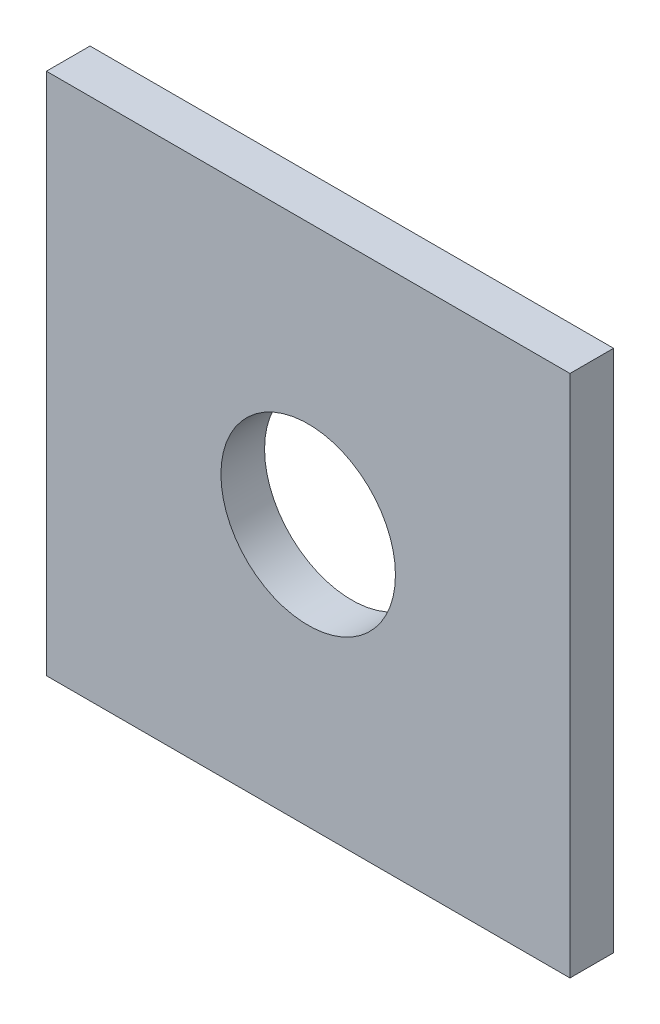
ISO-10303-21;
HEADER;
FILE_DESCRIPTION(('STEP AP214'),'2;1');
FILE_NAME('part.step','',(''),(''),'','','');
FILE_SCHEMA(('AUTOMOTIVE_DESIGN { 1 0 10303 214 1 1 1 1 }'));
ENDSEC;
DATA;
#1=APPLICATION_CONTEXT('core data for automotive mechanical design processes');
#2=APPLICATION_PROTOCOL_DEFINITION('international standard','automotive_design',2000,#1);
#3=PRODUCT_CONTEXT('',#1,'mechanical');
#4=PRODUCT('Part','Part','',(#3));
#5=PRODUCT_RELATED_PRODUCT_CATEGORY('part','',(#4));
#6=PRODUCT_DEFINITION_FORMATION('','',#4);
#7=PRODUCT_DEFINITION_CONTEXT('part definition',#1,'design');
#8=PRODUCT_DEFINITION('design','',#6,#7);
#9=PRODUCT_DEFINITION_SHAPE('','',#8);
#10=(LENGTH_UNIT() NAMED_UNIT(*) SI_UNIT(.MILLI.,.METRE.));
#11=(NAMED_UNIT(*) PLANE_ANGLE_UNIT() SI_UNIT($,.RADIAN.));
#12=(NAMED_UNIT(*) SI_UNIT($,.STERADIAN.) SOLID_ANGLE_UNIT());
#13=UNCERTAINTY_MEASURE_WITH_UNIT(LENGTH_MEASURE(1.E-05),#10,'distance_accuracy_value','');
#14=(GEOMETRIC_REPRESENTATION_CONTEXT(3) GLOBAL_UNCERTAINTY_ASSIGNED_CONTEXT((#13)) GLOBAL_UNIT_ASSIGNED_CONTEXT((#10,
#11,#12)) REPRESENTATION_CONTEXT('',''));
#15=CARTESIAN_POINT('',(0.,0.,0.));
#16=DIRECTION('',(0.,0.,1.));
#17=DIRECTION('',(1.,0.,0.));
#18=AXIS2_PLACEMENT_3D('',#15,#16,#17);
#19=CARTESIAN_POINT('',(0.,0.,12.7));
#20=DIRECTION('',(1.,0.,0.));
#21=DIRECTION('',(0.,0.,-1.));
#22=AXIS2_PLACEMENT_3D('',#19,#20,#21);
#23=PLANE('',#22);
#24=DIRECTION('',(0.,-1.,0.));
#25=VECTOR('',#24,1.);
#26=CARTESIAN_POINT('',(0.,0.,0.));
#27=LINE('',#26,#25);
#28=CARTESIAN_POINT('',(0.,152.4,0.));
#29=VERTEX_POINT('',#28);
#30=CARTESIAN_POINT('',(0.,0.,0.));
#31=VERTEX_POINT('',#30);
#32=EDGE_CURVE('E80',#29,#31,#27,.T.);
#33=ORIENTED_EDGE('',*,*,#32,.T.);
#34=DIRECTION('',(0.,0.,-1.));
#35=VECTOR('',#34,1.);
#36=CARTESIAN_POINT('',(0.,0.,12.7));
#37=LINE('',#36,#35);
#38=CARTESIAN_POINT('',(0.,0.,12.7));
#39=VERTEX_POINT('',#38);
#40=EDGE_CURVE('E11',#39,#31,#37,.T.);
#41=ORIENTED_EDGE('',*,*,#40,.F.);
#42=DIRECTION('',(0.,-1.,0.));
#43=VECTOR('',#42,1.);
#44=CARTESIAN_POINT('',(0.,0.,12.7));
#45=LINE('',#44,#43);
#46=CARTESIAN_POINT('',(0.,152.4,12.7));
#47=VERTEX_POINT('',#46);
#48=EDGE_CURVE('E68',#47,#39,#45,.T.);
#49=ORIENTED_EDGE('',*,*,#48,.F.);
#50=DIRECTION('',(0.,0.,-1.));
#51=VECTOR('',#50,1.);
#52=CARTESIAN_POINT('',(0.,152.4,12.7));
#53=LINE('',#52,#51);
#54=EDGE_CURVE('E76',#47,#29,#53,.T.);
#55=ORIENTED_EDGE('',*,*,#54,.T.);
#56=EDGE_LOOP('',(#33,#41,#49,#55));
#57=FACE_BOUND('',#56,.T.);
#58=ADVANCED_FACE('F17',(#57),#23,.F.);
#59=CARTESIAN_POINT('',(0.,0.,12.7));
#60=DIRECTION('',(0.,1.,0.));
#61=DIRECTION('',(0.,0.,1.));
#62=AXIS2_PLACEMENT_3D('',#59,#60,#61);
#63=PLANE('',#62);
#64=DIRECTION('',(1.,0.,0.));
#65=VECTOR('',#64,1.);
#66=CARTESIAN_POINT('',(0.,0.,0.));
#67=LINE('',#66,#65);
#68=CARTESIAN_POINT('',(152.4,0.,0.));
#69=VERTEX_POINT('',#68);
#70=EDGE_CURVE('E72',#31,#69,#67,.T.);
#71=ORIENTED_EDGE('',*,*,#70,.T.);
#72=DIRECTION('',(0.,0.,-1.));
#73=VECTOR('',#72,1.);
#74=CARTESIAN_POINT('',(152.4,0.,12.7));
#75=LINE('',#74,#73);
#76=CARTESIAN_POINT('',(152.4,0.,12.7));
#77=VERTEX_POINT('',#76);
#78=EDGE_CURVE('E25',#77,#69,#75,.T.);
#79=ORIENTED_EDGE('',*,*,#78,.F.);
#80=DIRECTION('',(1.,0.,0.));
#81=VECTOR('',#80,1.);
#82=CARTESIAN_POINT('',(0.,0.,12.7));
#83=LINE('',#82,#81);
#84=EDGE_CURVE('E63',#39,#77,#83,.T.);
#85=ORIENTED_EDGE('',*,*,#84,.F.);
#86=ORIENTED_EDGE('',*,*,#40,.T.);
#87=EDGE_LOOP('',(#71,#79,#85,#86));
#88=FACE_BOUND('',#87,.T.);
#89=ADVANCED_FACE('F71',(#88),#63,.F.);
#90=CARTESIAN_POINT('',(152.4,0.,12.7));
#91=DIRECTION('',(-1.,0.,0.));
#92=DIRECTION('',(0.,0.,1.));
#93=AXIS2_PLACEMENT_3D('',#90,#91,#92);
#94=PLANE('',#93);
#95=DIRECTION('',(0.,1.,0.));
#96=VECTOR('',#95,1.);
#97=CARTESIAN_POINT('',(152.4,0.,0.));
#98=LINE('',#97,#96);
#99=CARTESIAN_POINT('',(152.4,152.4,0.));
#100=VERTEX_POINT('',#99);
#101=EDGE_CURVE('E50',#69,#100,#98,.T.);
#102=ORIENTED_EDGE('',*,*,#101,.T.);
#103=DIRECTION('',(0.,0.,-1.));
#104=VECTOR('',#103,1.);
#105=CARTESIAN_POINT('',(152.4,152.4,12.7));
#106=LINE('',#105,#104);
#107=CARTESIAN_POINT('',(152.4,152.4,12.7));
#108=VERTEX_POINT('',#107);
#109=EDGE_CURVE('E73',#108,#100,#106,.T.);
#110=ORIENTED_EDGE('',*,*,#109,.F.);
#111=DIRECTION('',(0.,1.,0.));
#112=VECTOR('',#111,1.);
#113=CARTESIAN_POINT('',(152.4,0.,12.7));
#114=LINE('',#113,#112);
#115=EDGE_CURVE('E66',#77,#108,#114,.T.);
#116=ORIENTED_EDGE('',*,*,#115,.F.);
#117=ORIENTED_EDGE('',*,*,#78,.T.);
#118=EDGE_LOOP('',(#102,#110,#116,#117));
#119=FACE_BOUND('',#118,.T.);
#120=ADVANCED_FACE('F74',(#119),#94,.F.);
#121=CARTESIAN_POINT('',(0.,152.4,12.7));
#122=DIRECTION('',(0.,-1.,0.));
#123=DIRECTION('',(0.,0.,-1.));
#124=AXIS2_PLACEMENT_3D('',#121,#122,#123);
#125=PLANE('',#124);
#126=DIRECTION('',(-1.,0.,0.));
#127=VECTOR('',#126,1.);
#128=CARTESIAN_POINT('',(0.,152.4,0.));
#129=LINE('',#128,#127);
#130=EDGE_CURVE('E56',#100,#29,#129,.T.);
#131=ORIENTED_EDGE('',*,*,#130,.T.);
#132=ORIENTED_EDGE('',*,*,#54,.F.);
#133=DIRECTION('',(-1.,0.,0.));
#134=VECTOR('',#133,1.);
#135=CARTESIAN_POINT('',(0.,152.4,12.7));
#136=LINE('',#135,#134);
#137=EDGE_CURVE('E33',#108,#47,#136,.T.);
#138=ORIENTED_EDGE('',*,*,#137,.F.);
#139=ORIENTED_EDGE('',*,*,#109,.T.);
#140=EDGE_LOOP('',(#131,#132,#138,#139));
#141=FACE_BOUND('',#140,.T.);
#142=ADVANCED_FACE('F88',(#141),#125,.F.);
#143=CARTESIAN_POINT('',(0.,0.,12.7));
#144=DIRECTION('',(0.,0.,-1.));
#145=DIRECTION('',(-1.,0.,0.));
#146=AXIS2_PLACEMENT_3D('',#143,#144,#145);
#147=PLANE('',#146);
#148=CARTESIAN_POINT('',(76.2,76.2,12.7));
#149=DIRECTION('',(0.,0.,-1.));
#150=DIRECTION('',(-1.,0.,0.));
#151=AXIS2_PLACEMENT_3D('',#148,#149,#150);
#152=CIRCLE('',#151,25.4);
#153=CARTESIAN_POINT('',(50.8,76.2,12.7));
#154=VERTEX_POINT('',#153);
#155=EDGE_CURVE('E83',#154,#154,#152,.T.);
#156=ORIENTED_EDGE('',*,*,#155,.T.);
#157=EDGE_LOOP('',(#156));
#158=FACE_BOUND('',#157,.T.);
#159=ORIENTED_EDGE('',*,*,#48,.T.);
#160=ORIENTED_EDGE('',*,*,#84,.T.);
#161=ORIENTED_EDGE('',*,*,#115,.T.);
#162=ORIENTED_EDGE('',*,*,#137,.T.);
#163=EDGE_LOOP('',(#159,#160,#161,#162));
#164=FACE_BOUND('',#163,.T.);
#165=ADVANCED_FACE('F64',(#158,#164),#147,.F.);
#166=CARTESIAN_POINT('',(0.,0.,0.));
#167=DIRECTION('',(0.,0.,-1.));
#168=DIRECTION('',(-1.,0.,0.));
#169=AXIS2_PLACEMENT_3D('',#166,#167,#168);
#170=PLANE('',#169);
#171=CARTESIAN_POINT('',(76.2,76.2,0.));
#172=DIRECTION('',(0.,0.,-1.));
#173=DIRECTION('',(-1.,0.,0.));
#174=AXIS2_PLACEMENT_3D('',#171,#172,#173);
#175=CIRCLE('',#174,25.4);
#176=CARTESIAN_POINT('',(50.8,76.2,0.));
#177=VERTEX_POINT('',#176);
#178=EDGE_CURVE('E94',#177,#177,#175,.T.);
#179=ORIENTED_EDGE('',*,*,#178,.F.);
#180=EDGE_LOOP('',(#179));
#181=FACE_BOUND('',#180,.T.);
#182=ORIENTED_EDGE('',*,*,#32,.F.);
#183=ORIENTED_EDGE('',*,*,#130,.F.);
#184=ORIENTED_EDGE('',*,*,#101,.F.);
#185=ORIENTED_EDGE('',*,*,#70,.F.);
#186=EDGE_LOOP('',(#182,#183,#184,#185));
#187=FACE_BOUND('',#186,.T.);
#188=ADVANCED_FACE('F91',(#181,#187),#170,.T.);
#189=CARTESIAN_POINT('',(76.2,76.2,12.7));
#190=DIRECTION('',(0.,0.,-1.));
#191=DIRECTION('',(-1.,0.,0.));
#192=AXIS2_PLACEMENT_3D('',#189,#190,#191);
#193=CYLINDRICAL_SURFACE('',#192,25.4);
#194=ORIENTED_EDGE('',*,*,#155,.F.);
#195=EDGE_LOOP('',(#194));
#196=FACE_BOUND('',#195,.T.);
#197=ORIENTED_EDGE('',*,*,#178,.T.);
#198=EDGE_LOOP('',(#197));
#199=FACE_BOUND('',#198,.T.);
#200=ADVANCED_FACE('F101',(#196,#199),#193,.F.);
#201=CLOSED_SHELL('',(#58,#89,#120,#142,#165,#188,#200));
#202=MANIFOLD_SOLID_BREP('B1',#201);
#203=ADVANCED_BREP_SHAPE_REPRESENTATION('',(#18,#202),#14);
#204=SHAPE_DEFINITION_REPRESENTATION(#9,#203);
ENDSEC;
END-ISO-10303-21;
